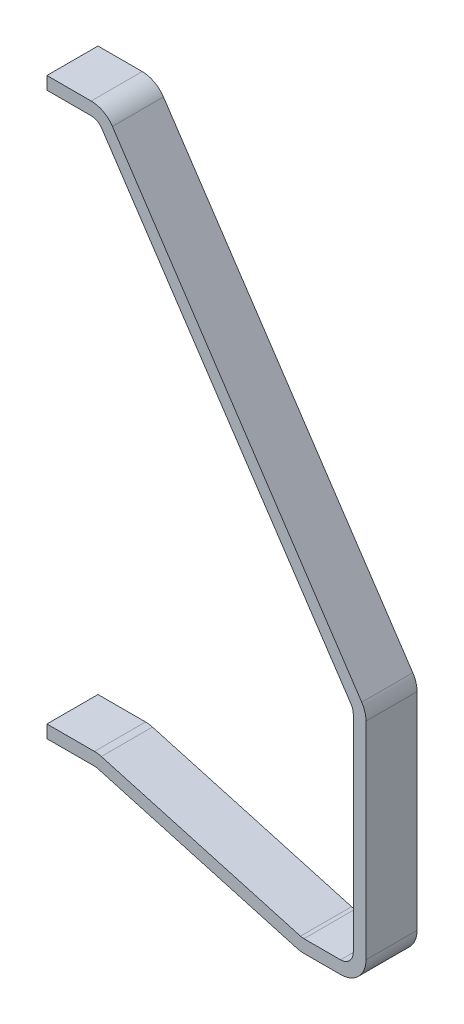
ISO-10303-21;
HEADER;
FILE_DESCRIPTION(('STEP AP214'),'2;1');
FILE_NAME('part.step','',(''),(''),'','','');
FILE_SCHEMA(('AUTOMOTIVE_DESIGN { 1 0 10303 214 1 1 1 1 }'));
ENDSEC;
DATA;
#1=APPLICATION_CONTEXT('core data for automotive mechanical design processes');
#2=APPLICATION_PROTOCOL_DEFINITION('international standard','automotive_design',2000,#1);
#3=PRODUCT_CONTEXT('',#1,'mechanical');
#4=PRODUCT('Part','Part','',(#3));
#5=PRODUCT_RELATED_PRODUCT_CATEGORY('part','',(#4));
#6=PRODUCT_DEFINITION_FORMATION('','',#4);
#7=PRODUCT_DEFINITION_CONTEXT('part definition',#1,'design');
#8=PRODUCT_DEFINITION('design','',#6,#7);
#9=PRODUCT_DEFINITION_SHAPE('','',#8);
#10=(LENGTH_UNIT() NAMED_UNIT(*) SI_UNIT(.MILLI.,.METRE.));
#11=(NAMED_UNIT(*) PLANE_ANGLE_UNIT() SI_UNIT($,.RADIAN.));
#12=(NAMED_UNIT(*) SI_UNIT($,.STERADIAN.) SOLID_ANGLE_UNIT());
#13=UNCERTAINTY_MEASURE_WITH_UNIT(LENGTH_MEASURE(1.E-05),#10,'distance_accuracy_value','');
#14=(GEOMETRIC_REPRESENTATION_CONTEXT(3) GLOBAL_UNCERTAINTY_ASSIGNED_CONTEXT((#13)) GLOBAL_UNIT_ASSIGNED_CONTEXT((#10,
#11,#12)) REPRESENTATION_CONTEXT('',''));
#15=CARTESIAN_POINT('',(0.,0.,0.));
#16=DIRECTION('',(0.,0.,1.));
#17=DIRECTION('',(1.,0.,0.));
#18=AXIS2_PLACEMENT_3D('',#15,#16,#17);
#19=CARTESIAN_POINT('',(25.4000000000002,-273.05,25.4));
#20=DIRECTION('',(0.,-1.,0.));
#21=DIRECTION('',(0.,0.,-1.));
#22=AXIS2_PLACEMENT_3D('',#19,#20,#21);
#23=PLANE('',#22);
#24=DIRECTION('',(-1.,0.,0.));
#25=VECTOR('',#24,1.);
#26=CARTESIAN_POINT('',(25.4000000000002,-273.05,25.4));
#27=LINE('',#26,#25);
#28=CARTESIAN_POINT('',(23.6480487199663,-273.05,25.4));
#29=VERTEX_POINT('',#28);
#30=CARTESIAN_POINT('',(1.87350135405495E-13,-273.05,25.4));
#31=VERTEX_POINT('',#30);
#32=EDGE_CURVE('E195',#29,#31,#27,.T.);
#33=ORIENTED_EDGE('',*,*,#32,.F.);
#34=DIRECTION('',(0.,0.,-1.));
#35=VECTOR('',#34,1.);
#36=CARTESIAN_POINT('',(23.6480487199663,-273.05,25.4));
#37=LINE('',#36,#35);
#38=CARTESIAN_POINT('',(23.6480487199663,-273.05,0.));
#39=VERTEX_POINT('',#38);
#40=EDGE_CURVE('E341',#29,#39,#37,.T.);
#41=ORIENTED_EDGE('',*,*,#40,.T.);
#42=DIRECTION('',(-1.,0.,0.));
#43=VECTOR('',#42,1.);
#44=CARTESIAN_POINT('',(25.4000000000002,-273.05,0.));
#45=LINE('',#44,#43);
#46=CARTESIAN_POINT('',(1.87350135405495E-13,-273.05,0.));
#47=VERTEX_POINT('',#46);
#48=EDGE_CURVE('E212',#39,#47,#45,.T.);
#49=ORIENTED_EDGE('',*,*,#48,.T.);
#50=DIRECTION('',(0.,0.,-1.));
#51=VECTOR('',#50,1.);
#52=CARTESIAN_POINT('',(1.87350135405495E-13,-273.05,25.4));
#53=LINE('',#52,#51);
#54=EDGE_CURVE('E210',#31,#47,#53,.T.);
#55=ORIENTED_EDGE('',*,*,#54,.F.);
#56=EDGE_LOOP('',(#33,#41,#49,#55));
#57=FACE_BOUND('',#56,.T.);
#58=ADVANCED_FACE('F33',(#57),#23,.F.);
#59=CARTESIAN_POINT('',(1.87350135405495E-13,-279.4,25.4));
#60=DIRECTION('',(-1.,0.,0.));
#61=DIRECTION('',(0.,0.,1.));
#62=AXIS2_PLACEMENT_3D('',#59,#60,#61);
#63=PLANE('',#62);
#64=DIRECTION('',(0.,1.,0.));
#65=VECTOR('',#64,1.);
#66=CARTESIAN_POINT('',(1.87350135405495E-13,-279.4,0.));
#67=LINE('',#66,#65);
#68=CARTESIAN_POINT('',(1.87350135405495E-13,-279.4,0.));
#69=VERTEX_POINT('',#68);
#70=EDGE_CURVE('E257',#69,#47,#67,.T.);
#71=ORIENTED_EDGE('',*,*,#70,.F.);
#72=DIRECTION('',(0.,0.,-1.));
#73=VECTOR('',#72,1.);
#74=CARTESIAN_POINT('',(1.87350135405495E-13,-279.4,25.4));
#75=LINE('',#74,#73);
#76=CARTESIAN_POINT('',(1.87350135405495E-13,-279.4,25.4));
#77=VERTEX_POINT('',#76);
#78=EDGE_CURVE('E217',#77,#69,#75,.T.);
#79=ORIENTED_EDGE('',*,*,#78,.F.);
#80=DIRECTION('',(0.,1.,0.));
#81=VECTOR('',#80,1.);
#82=CARTESIAN_POINT('',(1.87350135405495E-13,-279.4,25.4));
#83=LINE('',#82,#81);
#84=EDGE_CURVE('E201',#77,#31,#83,.T.);
#85=ORIENTED_EDGE('',*,*,#84,.T.);
#86=ORIENTED_EDGE('',*,*,#54,.T.);
#87=EDGE_LOOP('',(#71,#79,#85,#86));
#88=FACE_BOUND('',#87,.T.);
#89=ADVANCED_FACE('F220',(#88),#63,.T.);
#90=CARTESIAN_POINT('',(25.4000000000002,-279.4,25.4));
#91=DIRECTION('',(0.,-1.,0.));
#92=DIRECTION('',(0.,0.,-1.));
#93=AXIS2_PLACEMENT_3D('',#90,#91,#92);
#94=PLANE('',#93);
#95=DIRECTION('',(1.,0.,0.));
#96=VECTOR('',#95,1.);
#97=CARTESIAN_POINT('',(25.4000000000002,-279.4,0.));
#98=LINE('',#97,#96);
#99=CARTESIAN_POINT('',(23.6480487199665,-279.4,0.));
#100=VERTEX_POINT('',#99);
#101=EDGE_CURVE('E259',#100,#69,#98,.F.);
#102=ORIENTED_EDGE('',*,*,#101,.F.);
#103=DIRECTION('',(0.,0.,-1.));
#104=VECTOR('',#103,1.);
#105=CARTESIAN_POINT('',(23.6480487199665,-279.4,25.4));
#106=LINE('',#105,#104);
#107=CARTESIAN_POINT('',(23.6480487199665,-279.4,25.4));
#108=VERTEX_POINT('',#107);
#109=EDGE_CURVE('E298',#100,#108,#106,.F.);
#110=ORIENTED_EDGE('',*,*,#109,.T.);
#111=DIRECTION('',(1.,0.,0.));
#112=VECTOR('',#111,1.);
#113=CARTESIAN_POINT('',(25.4000000000002,-279.4,25.4));
#114=LINE('',#113,#112);
#115=EDGE_CURVE('E222',#108,#77,#114,.F.);
#116=ORIENTED_EDGE('',*,*,#115,.T.);
#117=ORIENTED_EDGE('',*,*,#78,.T.);
#118=EDGE_LOOP('',(#102,#110,#116,#117));
#119=FACE_BOUND('',#118,.T.);
#120=ADVANCED_FACE('F441',(#119),#94,.T.);
#121=CARTESIAN_POINT('',(125.280765586569,-307.737833469977,25.4));
#122=DIRECTION('',(-0.270745576918284,-0.962650940153899,0.));
#123=DIRECTION('',(0.962650940153899,-0.270745576918284,0.));
#124=AXIS2_PLACEMENT_3D('',#121,#122,#123);
#125=PLANE('',#124);
#126=DIRECTION('',(-0.962650940153899,0.270745576918284,0.));
#127=VECTOR('',#126,1.);
#128=CARTESIAN_POINT('',(125.280765586569,-307.737833469977,0.));
#129=LINE('',#128,#127);
#130=CARTESIAN_POINT('',(124.437506813155,-307.500666939955,0.));
#131=VERTEX_POINT('',#130);
#132=CARTESIAN_POINT('',(25.3672831333976,-279.637166530023,0.));
#133=VERTEX_POINT('',#132);
#134=EDGE_CURVE('E261',#131,#133,#129,.T.);
#135=ORIENTED_EDGE('',*,*,#134,.F.);
#136=DIRECTION('',(0.,0.,-1.));
#137=VECTOR('',#136,1.);
#138=CARTESIAN_POINT('',(124.437506813155,-307.500666939955,25.4));
#139=LINE('',#138,#137);
#140=CARTESIAN_POINT('',(124.437506813155,-307.500666939955,25.4));
#141=VERTEX_POINT('',#140);
#142=EDGE_CURVE('E367',#131,#141,#139,.F.);
#143=ORIENTED_EDGE('',*,*,#142,.T.);
#144=DIRECTION('',(-0.962650940153899,0.270745576918284,0.));
#145=VECTOR('',#144,1.);
#146=CARTESIAN_POINT('',(125.280765586569,-307.737833469977,25.4));
#147=LINE('',#146,#145);
#148=CARTESIAN_POINT('',(25.3672831333976,-279.637166530023,25.4));
#149=VERTEX_POINT('',#148);
#150=EDGE_CURVE('E224',#141,#149,#147,.T.);
#151=ORIENTED_EDGE('',*,*,#150,.T.);
#152=DIRECTION('',(0.,0.,-1.));
#153=VECTOR('',#152,1.);
#154=CARTESIAN_POINT('',(25.3672831333976,-279.637166530023,0.));
#155=LINE('',#154,#153);
#156=EDGE_CURVE('E216',#149,#133,#155,.T.);
#157=ORIENTED_EDGE('',*,*,#156,.T.);
#158=EDGE_LOOP('',(#135,#143,#151,#157));
#159=FACE_BOUND('',#158,.T.);
#160=ADVANCED_FACE('F449',(#159),#125,.T.);
#161=CARTESIAN_POINT('',(152.4,-307.975,25.4));
#162=DIRECTION('',(0.,-1.,0.));
#163=DIRECTION('',(1.,0.,0.));
#164=AXIS2_PLACEMENT_3D('',#161,#162,#163);
#165=PLANE('',#164);
#166=DIRECTION('',(-1.,0.,0.));
#167=VECTOR('',#166,1.);
#168=CARTESIAN_POINT('',(152.4,-307.975,25.4));
#169=LINE('',#168,#167);
#170=CARTESIAN_POINT('',(146.05,-307.975,25.4));
#171=VERTEX_POINT('',#170);
#172=CARTESIAN_POINT('',(127.875975640017,-307.975,25.4));
#173=VERTEX_POINT('',#172);
#174=EDGE_CURVE('E228',#171,#173,#169,.T.);
#175=ORIENTED_EDGE('',*,*,#174,.T.);
#176=DIRECTION('',(0.,0.,-1.));
#177=VECTOR('',#176,1.);
#178=CARTESIAN_POINT('',(127.875975640017,-307.975,25.4));
#179=LINE('',#178,#177);
#180=CARTESIAN_POINT('',(127.875975640017,-307.975,0.));
#181=VERTEX_POINT('',#180);
#182=EDGE_CURVE('E364',#173,#181,#179,.T.);
#183=ORIENTED_EDGE('',*,*,#182,.T.);
#184=DIRECTION('',(-1.,0.,0.));
#185=VECTOR('',#184,1.);
#186=CARTESIAN_POINT('',(152.4,-307.975,0.));
#187=LINE('',#186,#185);
#188=CARTESIAN_POINT('',(146.05,-307.975,0.));
#189=VERTEX_POINT('',#188);
#190=EDGE_CURVE('E263',#189,#181,#187,.T.);
#191=ORIENTED_EDGE('',*,*,#190,.F.);
#192=DIRECTION('',(0.,0.,-1.));
#193=VECTOR('',#192,1.);
#194=CARTESIAN_POINT('',(146.05,-307.975,25.4));
#195=LINE('',#194,#193);
#196=EDGE_CURVE('E362',#189,#171,#195,.F.);
#197=ORIENTED_EDGE('',*,*,#196,.T.);
#198=EDGE_LOOP('',(#175,#183,#191,#197));
#199=FACE_BOUND('',#198,.T.);
#200=ADVANCED_FACE('F458',(#199),#165,.T.);
#201=CARTESIAN_POINT('',(158.75,-190.5,25.4));
#202=DIRECTION('',(1.,0.,0.));
#203=DIRECTION('',(0.,1.,0.));
#204=AXIS2_PLACEMENT_3D('',#201,#202,#203);
#205=PLANE('',#204);
#206=DIRECTION('',(0.,-1.,0.));
#207=VECTOR('',#206,1.);
#208=CARTESIAN_POINT('',(158.75,-190.5,25.4));
#209=LINE('',#208,#207);
#210=CARTESIAN_POINT('',(158.75,-192.422625299598,25.4));
#211=VERTEX_POINT('',#210);
#212=CARTESIAN_POINT('',(158.75,-295.275,25.4));
#213=VERTEX_POINT('',#212);
#214=EDGE_CURVE('E231',#211,#213,#209,.T.);
#215=ORIENTED_EDGE('',*,*,#214,.T.);
#216=DIRECTION('',(0.,0.,-1.));
#217=VECTOR('',#216,1.);
#218=CARTESIAN_POINT('',(158.75,-295.275,25.4));
#219=LINE('',#218,#217);
#220=CARTESIAN_POINT('',(158.75,-295.275,0.));
#221=VERTEX_POINT('',#220);
#222=EDGE_CURVE('E371',#213,#221,#219,.T.);
#223=ORIENTED_EDGE('',*,*,#222,.T.);
#224=DIRECTION('',(0.,-1.,0.));
#225=VECTOR('',#224,1.);
#226=CARTESIAN_POINT('',(158.75,-190.5,0.));
#227=LINE('',#226,#225);
#228=CARTESIAN_POINT('',(158.75,-192.422625299598,0.));
#229=VERTEX_POINT('',#228);
#230=EDGE_CURVE('E266',#229,#221,#227,.T.);
#231=ORIENTED_EDGE('',*,*,#230,.F.);
#232=DIRECTION('',(0.,0.,-1.));
#233=VECTOR('',#232,1.);
#234=CARTESIAN_POINT('',(158.75,-192.422625299598,25.4));
#235=LINE('',#234,#233);
#236=EDGE_CURVE('E369',#229,#211,#235,.F.);
#237=ORIENTED_EDGE('',*,*,#236,.T.);
#238=EDGE_LOOP('',(#215,#223,#231,#237));
#239=FACE_BOUND('',#238,.T.);
#240=ADVANCED_FACE('F465',(#239),#205,.T.);
#241=CARTESIAN_POINT('',(30.6835193690453,3.5223462460302,25.4));
#242=DIRECTION('',(0.832050294337844,0.554700196225229,0.));
#243=DIRECTION('',(-0.554700196225229,0.832050294337844,0.));
#244=AXIS2_PLACEMENT_3D('',#241,#242,#243);
#245=PLANE('',#244);
#246=DIRECTION('',(0.554700196225229,-0.832050294337844,0.));
#247=VECTOR('',#246,1.);
#248=CARTESIAN_POINT('',(30.6835193690453,3.5223462460302,25.4));
#249=LINE('',#248,#247);
#250=CARTESIAN_POINT('',(32.5686218716918,0.69469249206041,25.4));
#251=VERTEX_POINT('',#250);
#252=CARTESIAN_POINT('',(156.617038738091,-185.377932807538,25.4));
#253=VERTEX_POINT('',#252);
#254=EDGE_CURVE('E234',#251,#253,#249,.T.);
#255=ORIENTED_EDGE('',*,*,#254,.T.);
#256=DIRECTION('',(0.,0.,-1.));
#257=VECTOR('',#256,1.);
#258=CARTESIAN_POINT('',(156.617038738091,-185.377932807538,25.4));
#259=LINE('',#258,#257);
#260=CARTESIAN_POINT('',(156.617038738091,-185.377932807538,0.));
#261=VERTEX_POINT('',#260);
#262=EDGE_CURVE('E41',#253,#261,#259,.T.);
#263=ORIENTED_EDGE('',*,*,#262,.T.);
#264=DIRECTION('',(0.554700196225229,-0.832050294337844,0.));
#265=VECTOR('',#264,1.);
#266=CARTESIAN_POINT('',(30.6835193690453,3.5223462460302,0.));
#267=LINE('',#266,#265);
#268=CARTESIAN_POINT('',(32.5686218716918,0.69469249206041,0.));
#269=VERTEX_POINT('',#268);
#270=EDGE_CURVE('E269',#269,#261,#267,.T.);
#271=ORIENTED_EDGE('',*,*,#270,.F.);
#272=DIRECTION('',(0.,0.,-1.));
#273=VECTOR('',#272,1.);
#274=CARTESIAN_POINT('',(32.5686218716918,0.69469249206041,25.4));
#275=LINE('',#274,#273);
#276=EDGE_CURVE('E374',#269,#251,#275,.F.);
#277=ORIENTED_EDGE('',*,*,#276,.T.);
#278=EDGE_LOOP('',(#255,#263,#271,#277));
#279=FACE_BOUND('',#278,.T.);
#280=ADVANCED_FACE('F379',(#279),#245,.T.);
#281=CARTESIAN_POINT('',(0.,6.35,25.4));
#282=DIRECTION('',(0.,1.,0.));
#283=DIRECTION('',(0.,0.,1.));
#284=AXIS2_PLACEMENT_3D('',#281,#282,#283);
#285=PLANE('',#284);
#286=DIRECTION('',(1.,0.,0.));
#287=VECTOR('',#286,1.);
#288=CARTESIAN_POINT('',(0.,6.35,25.4));
#289=LINE('',#288,#287);
#290=CARTESIAN_POINT('',(0.,6.35,25.4));
#291=VERTEX_POINT('',#290);
#292=CARTESIAN_POINT('',(22.0015831336012,6.35,25.4));
#293=VERTEX_POINT('',#292);
#294=EDGE_CURVE('E236',#291,#293,#289,.T.);
#295=ORIENTED_EDGE('',*,*,#294,.T.);
#296=DIRECTION('',(0.,0.,-1.));
#297=VECTOR('',#296,1.);
#298=CARTESIAN_POINT('',(22.0015831336012,6.35,25.4));
#299=LINE('',#298,#297);
#300=CARTESIAN_POINT('',(22.0015831336012,6.35,0.));
#301=VERTEX_POINT('',#300);
#302=EDGE_CURVE('E11',#293,#301,#299,.T.);
#303=ORIENTED_EDGE('',*,*,#302,.T.);
#304=DIRECTION('',(1.,0.,0.));
#305=VECTOR('',#304,1.);
#306=CARTESIAN_POINT('',(0.,6.35,0.));
#307=LINE('',#306,#305);
#308=CARTESIAN_POINT('',(0.,6.35,0.));
#309=VERTEX_POINT('',#308);
#310=EDGE_CURVE('E272',#309,#301,#307,.T.);
#311=ORIENTED_EDGE('',*,*,#310,.F.);
#312=DIRECTION('',(0.,0.,-1.));
#313=VECTOR('',#312,1.);
#314=CARTESIAN_POINT('',(0.,6.35,25.4));
#315=LINE('',#314,#313);
#316=EDGE_CURVE('E293',#291,#309,#315,.T.);
#317=ORIENTED_EDGE('',*,*,#316,.F.);
#318=EDGE_LOOP('',(#295,#303,#311,#317));
#319=FACE_BOUND('',#318,.T.);
#320=ADVANCED_FACE('F389',(#319),#285,.T.);
#321=CARTESIAN_POINT('',(0.,0.,25.4));
#322=DIRECTION('',(-1.,0.,0.));
#323=DIRECTION('',(0.,0.,1.));
#324=AXIS2_PLACEMENT_3D('',#321,#322,#323);
#325=PLANE('',#324);
#326=DIRECTION('',(0.,1.,0.));
#327=VECTOR('',#326,1.);
#328=CARTESIAN_POINT('',(0.,0.,0.));
#329=LINE('',#328,#327);
#330=CARTESIAN_POINT('',(0.,0.,0.));
#331=VERTEX_POINT('',#330);
#332=EDGE_CURVE('E275',#331,#309,#329,.T.);
#333=ORIENTED_EDGE('',*,*,#332,.F.);
#334=DIRECTION('',(0.,0.,-1.));
#335=VECTOR('',#334,1.);
#336=CARTESIAN_POINT('',(0.,0.,25.4));
#337=LINE('',#336,#335);
#338=CARTESIAN_POINT('',(0.,0.,25.4));
#339=VERTEX_POINT('',#338);
#340=EDGE_CURVE('E255',#339,#331,#337,.T.);
#341=ORIENTED_EDGE('',*,*,#340,.F.);
#342=DIRECTION('',(0.,1.,0.));
#343=VECTOR('',#342,1.);
#344=CARTESIAN_POINT('',(0.,0.,25.4));
#345=LINE('',#344,#343);
#346=EDGE_CURVE('E238',#339,#291,#345,.T.);
#347=ORIENTED_EDGE('',*,*,#346,.T.);
#348=ORIENTED_EDGE('',*,*,#316,.T.);
#349=EDGE_LOOP('',(#333,#341,#347,#348));
#350=FACE_BOUND('',#349,.T.);
#351=ADVANCED_FACE('F393',(#350),#325,.T.);
#352=CARTESIAN_POINT('',(0.,0.,25.4));
#353=DIRECTION('',(0.,1.,0.));
#354=DIRECTION('',(0.,0.,1.));
#355=AXIS2_PLACEMENT_3D('',#352,#353,#354);
#356=PLANE('',#355);
#357=DIRECTION('',(1.,0.,0.));
#358=VECTOR('',#357,1.);
#359=CARTESIAN_POINT('',(0.,0.,0.));
#360=LINE('',#359,#358);
#361=CARTESIAN_POINT('',(22.0015831336012,0.,0.));
#362=VERTEX_POINT('',#361);
#363=EDGE_CURVE('E278',#331,#362,#360,.T.);
#364=ORIENTED_EDGE('',*,*,#363,.T.);
#365=DIRECTION('',(0.,0.,-1.));
#366=VECTOR('',#365,1.);
#367=CARTESIAN_POINT('',(22.0015831336012,0.,25.4));
#368=LINE('',#367,#366);
#369=CARTESIAN_POINT('',(22.0015831336012,0.,25.4));
#370=VERTEX_POINT('',#369);
#371=EDGE_CURVE('E318',#362,#370,#368,.F.);
#372=ORIENTED_EDGE('',*,*,#371,.T.);
#373=DIRECTION('',(1.,0.,0.));
#374=VECTOR('',#373,1.);
#375=CARTESIAN_POINT('',(0.,0.,25.4));
#376=LINE('',#375,#374);
#377=EDGE_CURVE('E241',#339,#370,#376,.T.);
#378=ORIENTED_EDGE('',*,*,#377,.F.);
#379=ORIENTED_EDGE('',*,*,#340,.T.);
#380=EDGE_LOOP('',(#364,#372,#378,#379));
#381=FACE_BOUND('',#380,.T.);
#382=ADVANCED_FACE('F397',(#381),#356,.F.);
#383=CARTESIAN_POINT('',(25.4,0.,25.4));
#384=DIRECTION('',(0.832050294337844,0.554700196225229,0.));
#385=DIRECTION('',(-0.554700196225229,0.832050294337844,0.));
#386=AXIS2_PLACEMENT_3D('',#383,#384,#385);
#387=PLANE('',#386);
#388=DIRECTION('',(0.554700196225229,-0.832050294337844,0.));
#389=VECTOR('',#388,1.);
#390=CARTESIAN_POINT('',(25.4,0.,0.));
#391=LINE('',#390,#389);
#392=CARTESIAN_POINT('',(27.2851025026465,-2.82765375396979,0.));
#393=VERTEX_POINT('',#392);
#394=CARTESIAN_POINT('',(151.333519369045,-188.900279053568,0.));
#395=VERTEX_POINT('',#394);
#396=EDGE_CURVE('E281',#393,#395,#391,.T.);
#397=ORIENTED_EDGE('',*,*,#396,.T.);
#398=DIRECTION('',(0.,0.,-1.));
#399=VECTOR('',#398,1.);
#400=CARTESIAN_POINT('',(151.333519369045,-188.900279053568,25.4));
#401=LINE('',#400,#399);
#402=CARTESIAN_POINT('',(151.333519369045,-188.900279053568,25.4));
#403=VERTEX_POINT('',#402);
#404=EDGE_CURVE('E316',#395,#403,#401,.F.);
#405=ORIENTED_EDGE('',*,*,#404,.T.);
#406=DIRECTION('',(0.554700196225229,-0.832050294337844,0.));
#407=VECTOR('',#406,1.);
#408=CARTESIAN_POINT('',(25.4,0.,25.4));
#409=LINE('',#408,#407);
#410=CARTESIAN_POINT('',(27.2851025026465,-2.82765375396979,25.4));
#411=VERTEX_POINT('',#410);
#412=EDGE_CURVE('E244',#411,#403,#409,.T.);
#413=ORIENTED_EDGE('',*,*,#412,.F.);
#414=DIRECTION('',(0.,0.,-1.));
#415=VECTOR('',#414,1.);
#416=CARTESIAN_POINT('',(27.2851025026465,-2.82765375396979,0.));
#417=LINE('',#416,#415);
#418=EDGE_CURVE('E313',#411,#393,#417,.T.);
#419=ORIENTED_EDGE('',*,*,#418,.T.);
#420=EDGE_LOOP('',(#397,#405,#413,#419));
#421=FACE_BOUND('',#420,.T.);
#422=ADVANCED_FACE('F406',(#421),#387,.F.);
#423=CARTESIAN_POINT('',(152.4,-190.5,25.4));
#424=DIRECTION('',(1.,0.,0.));
#425=DIRECTION('',(0.,1.,0.));
#426=AXIS2_PLACEMENT_3D('',#423,#424,#425);
#427=PLANE('',#426);
#428=DIRECTION('',(0.,-1.,0.));
#429=VECTOR('',#428,1.);
#430=CARTESIAN_POINT('',(152.4,-190.5,0.));
#431=LINE('',#430,#429);
#432=CARTESIAN_POINT('',(152.4,-192.422625299598,0.));
#433=VERTEX_POINT('',#432);
#434=CARTESIAN_POINT('',(152.4,-295.275,0.));
#435=VERTEX_POINT('',#434);
#436=EDGE_CURVE('E284',#433,#435,#431,.T.);
#437=ORIENTED_EDGE('',*,*,#436,.T.);
#438=DIRECTION('',(0.,0.,-1.));
#439=VECTOR('',#438,1.);
#440=CARTESIAN_POINT('',(152.4,-295.275,25.4));
#441=LINE('',#440,#439);
#442=CARTESIAN_POINT('',(152.4,-295.275,25.4));
#443=VERTEX_POINT('',#442);
#444=EDGE_CURVE('E311',#435,#443,#441,.F.);
#445=ORIENTED_EDGE('',*,*,#444,.T.);
#446=DIRECTION('',(0.,-1.,0.));
#447=VECTOR('',#446,1.);
#448=CARTESIAN_POINT('',(152.4,-190.5,25.4));
#449=LINE('',#448,#447);
#450=CARTESIAN_POINT('',(152.4,-192.422625299598,25.4));
#451=VERTEX_POINT('',#450);
#452=EDGE_CURVE('E247',#451,#443,#449,.T.);
#453=ORIENTED_EDGE('',*,*,#452,.F.);
#454=DIRECTION('',(0.,0.,-1.));
#455=VECTOR('',#454,1.);
#456=CARTESIAN_POINT('',(152.4,-192.422625299598,0.));
#457=LINE('',#456,#455);
#458=EDGE_CURVE('E308',#451,#433,#457,.T.);
#459=ORIENTED_EDGE('',*,*,#458,.T.);
#460=EDGE_LOOP('',(#437,#445,#453,#459));
#461=FACE_BOUND('',#460,.T.);
#462=ADVANCED_FACE('F415',(#461),#427,.F.);
#463=CARTESIAN_POINT('',(152.4,-301.625,25.4));
#464=DIRECTION('',(0.,-1.,0.));
#465=DIRECTION('',(1.,0.,0.));
#466=AXIS2_PLACEMENT_3D('',#463,#464,#465);
#467=PLANE('',#466);
#468=DIRECTION('',(-1.,0.,0.));
#469=VECTOR('',#468,1.);
#470=CARTESIAN_POINT('',(152.4,-301.625,0.));
#471=LINE('',#470,#469);
#472=CARTESIAN_POINT('',(146.05,-301.625,0.));
#473=VERTEX_POINT('',#472);
#474=CARTESIAN_POINT('',(127.875975640017,-301.625,0.));
#475=VERTEX_POINT('',#474);
#476=EDGE_CURVE('E287',#473,#475,#471,.T.);
#477=ORIENTED_EDGE('',*,*,#476,.T.);
#478=DIRECTION('',(0.,0.,-1.));
#479=VECTOR('',#478,1.);
#480=CARTESIAN_POINT('',(127.875975640017,-301.625,25.4));
#481=LINE('',#480,#479);
#482=CARTESIAN_POINT('',(127.875975640017,-301.625,25.4));
#483=VERTEX_POINT('',#482);
#484=EDGE_CURVE('E306',#475,#483,#481,.F.);
#485=ORIENTED_EDGE('',*,*,#484,.T.);
#486=DIRECTION('',(-1.,0.,0.));
#487=VECTOR('',#486,1.);
#488=CARTESIAN_POINT('',(152.4,-301.625,25.4));
#489=LINE('',#488,#487);
#490=CARTESIAN_POINT('',(146.05,-301.625,25.4));
#491=VERTEX_POINT('',#490);
#492=EDGE_CURVE('E250',#491,#483,#489,.T.);
#493=ORIENTED_EDGE('',*,*,#492,.F.);
#494=DIRECTION('',(0.,0.,-1.));
#495=VECTOR('',#494,1.);
#496=CARTESIAN_POINT('',(146.05,-301.625,0.));
#497=LINE('',#496,#495);
#498=EDGE_CURVE('E303',#491,#473,#497,.T.);
#499=ORIENTED_EDGE('',*,*,#498,.T.);
#500=EDGE_LOOP('',(#477,#485,#493,#499));
#501=FACE_BOUND('',#500,.T.);
#502=ADVANCED_FACE('F424',(#501),#467,.F.);
#503=CARTESIAN_POINT('',(127.,-301.625,25.4));
#504=DIRECTION('',(-0.270745576918284,-0.962650940153899,0.));
#505=DIRECTION('',(0.962650940153899,-0.270745576918284,0.));
#506=AXIS2_PLACEMENT_3D('',#503,#504,#505);
#507=PLANE('',#506);
#508=DIRECTION('',(-0.962650940153899,0.270745576918284,0.));
#509=VECTOR('',#508,1.);
#510=CARTESIAN_POINT('',(127.,-301.625,0.));
#511=LINE('',#510,#509);
#512=CARTESIAN_POINT('',(126.156741226586,-301.387833469977,0.));
#513=VERTEX_POINT('',#512);
#514=CARTESIAN_POINT('',(27.0865175468285,-273.524333060046,0.));
#515=VERTEX_POINT('',#514);
#516=EDGE_CURVE('E207',#513,#515,#511,.T.);
#517=ORIENTED_EDGE('',*,*,#516,.T.);
#518=DIRECTION('',(0.,0.,-1.));
#519=VECTOR('',#518,1.);
#520=CARTESIAN_POINT('',(27.0865175468285,-273.524333060046,25.4));
#521=LINE('',#520,#519);
#522=CARTESIAN_POINT('',(27.0865175468285,-273.524333060046,25.4));
#523=VERTEX_POINT('',#522);
#524=EDGE_CURVE('E353',#515,#523,#521,.F.);
#525=ORIENTED_EDGE('',*,*,#524,.T.);
#526=DIRECTION('',(-0.962650940153899,0.270745576918284,0.));
#527=VECTOR('',#526,1.);
#528=CARTESIAN_POINT('',(127.,-301.625,25.4));
#529=LINE('',#528,#527);
#530=CARTESIAN_POINT('',(126.156741226586,-301.387833469977,25.4));
#531=VERTEX_POINT('',#530);
#532=EDGE_CURVE('E253',#531,#523,#529,.T.);
#533=ORIENTED_EDGE('',*,*,#532,.F.);
#534=DIRECTION('',(0.,0.,-1.));
#535=VECTOR('',#534,1.);
#536=CARTESIAN_POINT('',(126.156741226586,-301.387833469977,0.));
#537=LINE('',#536,#535);
#538=EDGE_CURVE('E300',#531,#513,#537,.T.);
#539=ORIENTED_EDGE('',*,*,#538,.T.);
#540=EDGE_LOOP('',(#517,#525,#533,#539));
#541=FACE_BOUND('',#540,.T.);
#542=ADVANCED_FACE('F433',(#541),#507,.F.);
#543=CARTESIAN_POINT('',(0.,0.,25.4));
#544=DIRECTION('',(0.,0.,-1.));
#545=DIRECTION('',(-1.,0.,0.));
#546=AXIS2_PLACEMENT_3D('',#543,#544,#545);
#547=PLANE('',#546);
#548=ORIENTED_EDGE('',*,*,#532,.T.);
#549=CARTESIAN_POINT('',(23.6480487199663,-285.75,25.4));
#550=DIRECTION('',(0.,0.,-1.));
#551=DIRECTION('',(-1.,0.,0.));
#552=AXIS2_PLACEMENT_3D('',#549,#550,#551);
#553=CIRCLE('',#552,12.7);
#554=EDGE_CURVE('E203',#523,#29,#553,.F.);
#555=ORIENTED_EDGE('',*,*,#554,.T.);
#556=ORIENTED_EDGE('',*,*,#32,.T.);
#557=ORIENTED_EDGE('',*,*,#84,.F.);
#558=ORIENTED_EDGE('',*,*,#115,.F.);
#559=CARTESIAN_POINT('',(23.6480487199665,-285.75,25.4));
#560=DIRECTION('',(0.,0.,-1.));
#561=DIRECTION('',(-1.,0.,0.));
#562=AXIS2_PLACEMENT_3D('',#559,#560,#561);
#563=CIRCLE('',#562,6.35);
#564=EDGE_CURVE('E322',#108,#149,#563,.T.);
#565=ORIENTED_EDGE('',*,*,#564,.T.);
#566=ORIENTED_EDGE('',*,*,#150,.F.);
#567=CARTESIAN_POINT('',(127.875975640017,-295.275,25.4));
#568=DIRECTION('',(0.,0.,-1.));
#569=DIRECTION('',(-1.,0.,0.));
#570=AXIS2_PLACEMENT_3D('',#567,#568,#569);
#571=CIRCLE('',#570,12.7);
#572=EDGE_CURVE('E359',#141,#173,#571,.F.);
#573=ORIENTED_EDGE('',*,*,#572,.T.);
#574=ORIENTED_EDGE('',*,*,#174,.F.);
#575=CARTESIAN_POINT('',(146.05,-295.275,25.4));
#576=DIRECTION('',(0.,0.,-1.));
#577=DIRECTION('',(-1.,0.,0.));
#578=AXIS2_PLACEMENT_3D('',#575,#576,#577);
#579=CIRCLE('',#578,12.7);
#580=EDGE_CURVE('E357',#171,#213,#579,.F.);
#581=ORIENTED_EDGE('',*,*,#580,.T.);
#582=ORIENTED_EDGE('',*,*,#214,.F.);
#583=CARTESIAN_POINT('',(146.05,-192.422625299598,25.4));
#584=DIRECTION('',(0.,0.,-1.));
#585=DIRECTION('',(-1.,0.,0.));
#586=AXIS2_PLACEMENT_3D('',#583,#584,#585);
#587=CIRCLE('',#586,12.7);
#588=EDGE_CURVE('E54',#211,#253,#587,.F.);
#589=ORIENTED_EDGE('',*,*,#588,.T.);
#590=ORIENTED_EDGE('',*,*,#254,.F.);
#591=CARTESIAN_POINT('',(22.0015831336012,-6.35,25.4));
#592=DIRECTION('',(0.,0.,-1.));
#593=DIRECTION('',(-1.,0.,0.));
#594=AXIS2_PLACEMENT_3D('',#591,#592,#593);
#595=CIRCLE('',#594,12.7);
#596=EDGE_CURVE('E48',#251,#293,#595,.F.);
#597=ORIENTED_EDGE('',*,*,#596,.T.);
#598=ORIENTED_EDGE('',*,*,#294,.F.);
#599=ORIENTED_EDGE('',*,*,#346,.F.);
#600=ORIENTED_EDGE('',*,*,#377,.T.);
#601=CARTESIAN_POINT('',(22.0015831336012,-6.35,25.4));
#602=DIRECTION('',(0.,0.,-1.));
#603=DIRECTION('',(-1.,0.,0.));
#604=AXIS2_PLACEMENT_3D('',#601,#602,#603);
#605=CIRCLE('',#604,6.35);
#606=EDGE_CURVE('E339',#370,#411,#605,.T.);
#607=ORIENTED_EDGE('',*,*,#606,.T.);
#608=ORIENTED_EDGE('',*,*,#412,.T.);
#609=CARTESIAN_POINT('',(146.05,-192.422625299598,25.4));
#610=DIRECTION('',(0.,0.,-1.));
#611=DIRECTION('',(-1.,0.,0.));
#612=AXIS2_PLACEMENT_3D('',#609,#610,#611);
#613=CIRCLE('',#612,6.35);
#614=EDGE_CURVE('E335',#403,#451,#613,.T.);
#615=ORIENTED_EDGE('',*,*,#614,.T.);
#616=ORIENTED_EDGE('',*,*,#452,.T.);
#617=CARTESIAN_POINT('',(146.05,-295.275,25.4));
#618=DIRECTION('',(0.,0.,-1.));
#619=DIRECTION('',(-1.,0.,0.));
#620=AXIS2_PLACEMENT_3D('',#617,#618,#619);
#621=CIRCLE('',#620,6.35);
#622=EDGE_CURVE('E331',#443,#491,#621,.T.);
#623=ORIENTED_EDGE('',*,*,#622,.T.);
#624=ORIENTED_EDGE('',*,*,#492,.T.);
#625=CARTESIAN_POINT('',(127.875975640017,-295.275,25.4));
#626=DIRECTION('',(0.,0.,-1.));
#627=DIRECTION('',(-1.,0.,0.));
#628=AXIS2_PLACEMENT_3D('',#625,#626,#627);
#629=CIRCLE('',#628,6.35);
#630=EDGE_CURVE('E327',#483,#531,#629,.T.);
#631=ORIENTED_EDGE('',*,*,#630,.T.);
#632=EDGE_LOOP('',(#548,#555,#556,#557,#558,#565,#566,#573,#574,#581,#582,#589,#590,#597,#598,
#599,#600,#607,#608,#615,#616,#623,#624,#631));
#633=FACE_BOUND('',#632,.T.);
#634=ADVANCED_FACE('F198',(#633),#547,.F.);
#635=CARTESIAN_POINT('',(0.,0.,0.));
#636=DIRECTION('',(0.,0.,-1.));
#637=DIRECTION('',(-1.,0.,0.));
#638=AXIS2_PLACEMENT_3D('',#635,#636,#637);
#639=PLANE('',#638);
#640=ORIENTED_EDGE('',*,*,#48,.F.);
#641=CARTESIAN_POINT('',(23.6480487199663,-285.75,0.));
#642=DIRECTION('',(0.,0.,-1.));
#643=DIRECTION('',(-1.,0.,0.));
#644=AXIS2_PLACEMENT_3D('',#641,#642,#643);
#645=CIRCLE('',#644,12.7);
#646=EDGE_CURVE('E351',#39,#515,#645,.T.);
#647=ORIENTED_EDGE('',*,*,#646,.T.);
#648=ORIENTED_EDGE('',*,*,#516,.F.);
#649=CARTESIAN_POINT('',(127.875975640017,-295.275,0.));
#650=DIRECTION('',(0.,0.,-1.));
#651=DIRECTION('',(-1.,0.,0.));
#652=AXIS2_PLACEMENT_3D('',#649,#650,#651);
#653=CIRCLE('',#652,6.35);
#654=EDGE_CURVE('E325',#513,#475,#653,.F.);
#655=ORIENTED_EDGE('',*,*,#654,.T.);
#656=ORIENTED_EDGE('',*,*,#476,.F.);
#657=CARTESIAN_POINT('',(146.05,-295.275,0.));
#658=DIRECTION('',(0.,0.,-1.));
#659=DIRECTION('',(-1.,0.,0.));
#660=AXIS2_PLACEMENT_3D('',#657,#658,#659);
#661=CIRCLE('',#660,6.35);
#662=EDGE_CURVE('E329',#473,#435,#661,.F.);
#663=ORIENTED_EDGE('',*,*,#662,.T.);
#664=ORIENTED_EDGE('',*,*,#436,.F.);
#665=CARTESIAN_POINT('',(146.05,-192.422625299598,0.));
#666=DIRECTION('',(0.,0.,-1.));
#667=DIRECTION('',(-1.,0.,0.));
#668=AXIS2_PLACEMENT_3D('',#665,#666,#667);
#669=CIRCLE('',#668,6.35);
#670=EDGE_CURVE('E333',#433,#395,#669,.F.);
#671=ORIENTED_EDGE('',*,*,#670,.T.);
#672=ORIENTED_EDGE('',*,*,#396,.F.);
#673=CARTESIAN_POINT('',(22.0015831336012,-6.35,0.));
#674=DIRECTION('',(0.,0.,-1.));
#675=DIRECTION('',(-1.,0.,0.));
#676=AXIS2_PLACEMENT_3D('',#673,#674,#675);
#677=CIRCLE('',#676,6.35);
#678=EDGE_CURVE('E337',#393,#362,#677,.F.);
#679=ORIENTED_EDGE('',*,*,#678,.T.);
#680=ORIENTED_EDGE('',*,*,#363,.F.);
#681=ORIENTED_EDGE('',*,*,#332,.T.);
#682=ORIENTED_EDGE('',*,*,#310,.T.);
#683=CARTESIAN_POINT('',(22.0015831336012,-6.35,0.));
#684=DIRECTION('',(0.,0.,-1.));
#685=DIRECTION('',(-1.,0.,0.));
#686=AXIS2_PLACEMENT_3D('',#683,#684,#685);
#687=CIRCLE('',#686,12.7);
#688=EDGE_CURVE('E343',#301,#269,#687,.T.);
#689=ORIENTED_EDGE('',*,*,#688,.T.);
#690=ORIENTED_EDGE('',*,*,#270,.T.);
#691=CARTESIAN_POINT('',(146.05,-192.422625299598,0.));
#692=DIRECTION('',(0.,0.,-1.));
#693=DIRECTION('',(-1.,0.,0.));
#694=AXIS2_PLACEMENT_3D('',#691,#692,#693);
#695=CIRCLE('',#694,12.7);
#696=EDGE_CURVE('E345',#261,#229,#695,.T.);
#697=ORIENTED_EDGE('',*,*,#696,.T.);
#698=ORIENTED_EDGE('',*,*,#230,.T.);
#699=CARTESIAN_POINT('',(146.05,-295.275,0.));
#700=DIRECTION('',(0.,0.,-1.));
#701=DIRECTION('',(-1.,0.,0.));
#702=AXIS2_PLACEMENT_3D('',#699,#700,#701);
#703=CIRCLE('',#702,12.7);
#704=EDGE_CURVE('E347',#221,#189,#703,.T.);
#705=ORIENTED_EDGE('',*,*,#704,.T.);
#706=ORIENTED_EDGE('',*,*,#190,.T.);
#707=CARTESIAN_POINT('',(127.875975640017,-295.275,0.));
#708=DIRECTION('',(0.,0.,-1.));
#709=DIRECTION('',(-1.,0.,0.));
#710=AXIS2_PLACEMENT_3D('',#707,#708,#709);
#711=CIRCLE('',#710,12.7);
#712=EDGE_CURVE('E349',#181,#131,#711,.T.);
#713=ORIENTED_EDGE('',*,*,#712,.T.);
#714=ORIENTED_EDGE('',*,*,#134,.T.);
#715=CARTESIAN_POINT('',(23.6480487199665,-285.75,0.));
#716=DIRECTION('',(0.,0.,-1.));
#717=DIRECTION('',(-1.,0.,0.));
#718=AXIS2_PLACEMENT_3D('',#715,#716,#717);
#719=CIRCLE('',#718,6.35);
#720=EDGE_CURVE('E320',#133,#100,#719,.F.);
#721=ORIENTED_EDGE('',*,*,#720,.T.);
#722=ORIENTED_EDGE('',*,*,#101,.T.);
#723=ORIENTED_EDGE('',*,*,#70,.T.);
#724=EDGE_LOOP('',(#640,#647,#648,#655,#656,#663,#664,#671,#672,#679,#680,#681,#682,#689,#690,
#697,#698,#705,#706,#713,#714,#721,#722,#723));
#725=FACE_BOUND('',#724,.T.);
#726=ADVANCED_FACE('F383',(#725),#639,.T.);
#727=CARTESIAN_POINT('',(23.6480487199665,-285.75,25.4));
#728=DIRECTION('',(0.,0.,1.));
#729=DIRECTION('',(1.,0.,0.));
#730=AXIS2_PLACEMENT_3D('',#727,#728,#729);
#731=CYLINDRICAL_SURFACE('',#730,6.35);
#732=ORIENTED_EDGE('',*,*,#564,.F.);
#733=ORIENTED_EDGE('',*,*,#109,.F.);
#734=ORIENTED_EDGE('',*,*,#720,.F.);
#735=ORIENTED_EDGE('',*,*,#156,.F.);
#736=EDGE_LOOP('',(#732,#733,#734,#735));
#737=FACE_BOUND('',#736,.T.);
#738=ADVANCED_FACE('F446',(#737),#731,.F.);
#739=CARTESIAN_POINT('',(127.875975640017,-295.275,25.4));
#740=DIRECTION('',(0.,0.,1.));
#741=DIRECTION('',(1.,0.,0.));
#742=AXIS2_PLACEMENT_3D('',#739,#740,#741);
#743=CYLINDRICAL_SURFACE('',#742,6.35);
#744=ORIENTED_EDGE('',*,*,#630,.F.);
#745=ORIENTED_EDGE('',*,*,#484,.F.);
#746=ORIENTED_EDGE('',*,*,#654,.F.);
#747=ORIENTED_EDGE('',*,*,#538,.F.);
#748=EDGE_LOOP('',(#744,#745,#746,#747));
#749=FACE_BOUND('',#748,.T.);
#750=ADVANCED_FACE('F430',(#749),#743,.F.);
#751=CARTESIAN_POINT('',(146.05,-295.275,25.4));
#752=DIRECTION('',(0.,0.,1.));
#753=DIRECTION('',(1.,0.,0.));
#754=AXIS2_PLACEMENT_3D('',#751,#752,#753);
#755=CYLINDRICAL_SURFACE('',#754,6.35);
#756=ORIENTED_EDGE('',*,*,#622,.F.);
#757=ORIENTED_EDGE('',*,*,#444,.F.);
#758=ORIENTED_EDGE('',*,*,#662,.F.);
#759=ORIENTED_EDGE('',*,*,#498,.F.);
#760=EDGE_LOOP('',(#756,#757,#758,#759));
#761=FACE_BOUND('',#760,.T.);
#762=ADVANCED_FACE('F421',(#761),#755,.F.);
#763=CARTESIAN_POINT('',(146.05,-192.422625299598,25.4));
#764=DIRECTION('',(0.,0.,1.));
#765=DIRECTION('',(1.,0.,0.));
#766=AXIS2_PLACEMENT_3D('',#763,#764,#765);
#767=CYLINDRICAL_SURFACE('',#766,6.35);
#768=ORIENTED_EDGE('',*,*,#614,.F.);
#769=ORIENTED_EDGE('',*,*,#404,.F.);
#770=ORIENTED_EDGE('',*,*,#670,.F.);
#771=ORIENTED_EDGE('',*,*,#458,.F.);
#772=EDGE_LOOP('',(#768,#769,#770,#771));
#773=FACE_BOUND('',#772,.T.);
#774=ADVANCED_FACE('F412',(#773),#767,.F.);
#775=CARTESIAN_POINT('',(22.0015831336012,-6.35,25.4));
#776=DIRECTION('',(0.,0.,1.));
#777=DIRECTION('',(1.,0.,0.));
#778=AXIS2_PLACEMENT_3D('',#775,#776,#777);
#779=CYLINDRICAL_SURFACE('',#778,6.35);
#780=ORIENTED_EDGE('',*,*,#606,.F.);
#781=ORIENTED_EDGE('',*,*,#371,.F.);
#782=ORIENTED_EDGE('',*,*,#678,.F.);
#783=ORIENTED_EDGE('',*,*,#418,.F.);
#784=EDGE_LOOP('',(#780,#781,#782,#783));
#785=FACE_BOUND('',#784,.T.);
#786=ADVANCED_FACE('F403',(#785),#779,.F.);
#787=CARTESIAN_POINT('',(23.6480487199663,-285.75,25.4));
#788=DIRECTION('',(0.,0.,-1.));
#789=DIRECTION('',(-1.,0.,0.));
#790=AXIS2_PLACEMENT_3D('',#787,#788,#789);
#791=CYLINDRICAL_SURFACE('',#790,12.7);
#792=ORIENTED_EDGE('',*,*,#554,.F.);
#793=ORIENTED_EDGE('',*,*,#524,.F.);
#794=ORIENTED_EDGE('',*,*,#646,.F.);
#795=ORIENTED_EDGE('',*,*,#40,.F.);
#796=EDGE_LOOP('',(#792,#793,#794,#795));
#797=FACE_BOUND('',#796,.T.);
#798=ADVANCED_FACE('F436',(#797),#791,.T.);
#799=CARTESIAN_POINT('',(127.875975640017,-295.275,25.4));
#800=DIRECTION('',(0.,0.,-1.));
#801=DIRECTION('',(-1.,0.,0.));
#802=AXIS2_PLACEMENT_3D('',#799,#800,#801);
#803=CYLINDRICAL_SURFACE('',#802,12.7);
#804=ORIENTED_EDGE('',*,*,#572,.F.);
#805=ORIENTED_EDGE('',*,*,#142,.F.);
#806=ORIENTED_EDGE('',*,*,#712,.F.);
#807=ORIENTED_EDGE('',*,*,#182,.F.);
#808=EDGE_LOOP('',(#804,#805,#806,#807));
#809=FACE_BOUND('',#808,.T.);
#810=ADVANCED_FACE('F455',(#809),#803,.T.);
#811=CARTESIAN_POINT('',(146.05,-295.275,25.4));
#812=DIRECTION('',(0.,0.,-1.));
#813=DIRECTION('',(-1.,0.,0.));
#814=AXIS2_PLACEMENT_3D('',#811,#812,#813);
#815=CYLINDRICAL_SURFACE('',#814,12.7);
#816=ORIENTED_EDGE('',*,*,#580,.F.);
#817=ORIENTED_EDGE('',*,*,#196,.F.);
#818=ORIENTED_EDGE('',*,*,#704,.F.);
#819=ORIENTED_EDGE('',*,*,#222,.F.);
#820=EDGE_LOOP('',(#816,#817,#818,#819));
#821=FACE_BOUND('',#820,.T.);
#822=ADVANCED_FACE('F463',(#821),#815,.T.);
#823=CARTESIAN_POINT('',(146.05,-192.422625299598,25.4));
#824=DIRECTION('',(0.,0.,-1.));
#825=DIRECTION('',(-1.,0.,0.));
#826=AXIS2_PLACEMENT_3D('',#823,#824,#825);
#827=CYLINDRICAL_SURFACE('',#826,12.7);
#828=ORIENTED_EDGE('',*,*,#588,.F.);
#829=ORIENTED_EDGE('',*,*,#236,.F.);
#830=ORIENTED_EDGE('',*,*,#696,.F.);
#831=ORIENTED_EDGE('',*,*,#262,.F.);
#832=EDGE_LOOP('',(#828,#829,#830,#831));
#833=FACE_BOUND('',#832,.T.);
#834=ADVANCED_FACE('F467',(#833),#827,.T.);
#835=CARTESIAN_POINT('',(22.0015831336012,-6.35,25.4));
#836=DIRECTION('',(0.,0.,-1.));
#837=DIRECTION('',(-1.,0.,0.));
#838=AXIS2_PLACEMENT_3D('',#835,#836,#837);
#839=CYLINDRICAL_SURFACE('',#838,12.7);
#840=ORIENTED_EDGE('',*,*,#596,.F.);
#841=ORIENTED_EDGE('',*,*,#276,.F.);
#842=ORIENTED_EDGE('',*,*,#688,.F.);
#843=ORIENTED_EDGE('',*,*,#302,.F.);
#844=EDGE_LOOP('',(#840,#841,#842,#843));
#845=FACE_BOUND('',#844,.T.);
#846=ADVANCED_FACE('F35',(#845),#839,.T.);
#847=CLOSED_SHELL('',(#58,#89,#120,#160,#200,#240,#280,#320,#351,#382,#422,#462,#502,#542,#634,
#726,#738,#750,#762,#774,#786,#798,#810,#822,#834,#846));
#848=MANIFOLD_SOLID_BREP('B2',#847);
#849=ADVANCED_BREP_SHAPE_REPRESENTATION('',(#18,#848),#14);
#850=SHAPE_DEFINITION_REPRESENTATION(#9,#849);
ENDSEC;
END-ISO-10303-21;
